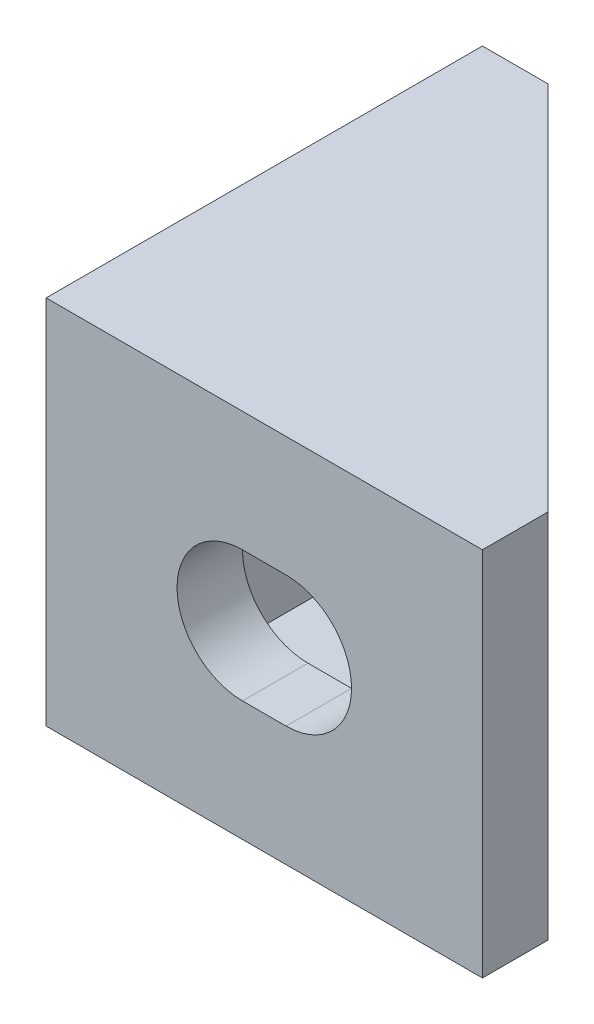
ISO-10303-21;
HEADER;
FILE_DESCRIPTION(('STEP AP214'),'2;1');
FILE_NAME('part.step','',(''),(''),'','','');
FILE_SCHEMA(('AUTOMOTIVE_DESIGN { 1 0 10303 214 1 1 1 1 }'));
ENDSEC;
DATA;
#1=APPLICATION_CONTEXT('core data for automotive mechanical design processes');
#2=APPLICATION_PROTOCOL_DEFINITION('international standard','automotive_design',2000,#1);
#3=PRODUCT_CONTEXT('',#1,'mechanical');
#4=PRODUCT('Part','Part','',(#3));
#5=PRODUCT_RELATED_PRODUCT_CATEGORY('part','',(#4));
#6=PRODUCT_DEFINITION_FORMATION('','',#4);
#7=PRODUCT_DEFINITION_CONTEXT('part definition',#1,'design');
#8=PRODUCT_DEFINITION('design','',#6,#7);
#9=PRODUCT_DEFINITION_SHAPE('','',#8);
#10=(LENGTH_UNIT() NAMED_UNIT(*) SI_UNIT(.MILLI.,.METRE.));
#11=(NAMED_UNIT(*) PLANE_ANGLE_UNIT() SI_UNIT($,.RADIAN.));
#12=(NAMED_UNIT(*) SI_UNIT($,.STERADIAN.) SOLID_ANGLE_UNIT());
#13=UNCERTAINTY_MEASURE_WITH_UNIT(LENGTH_MEASURE(1.E-05),#10,'distance_accuracy_value','');
#14=(GEOMETRIC_REPRESENTATION_CONTEXT(3) GLOBAL_UNCERTAINTY_ASSIGNED_CONTEXT((#13)) GLOBAL_UNIT_ASSIGNED_CONTEXT((#10,
#11,#12)) REPRESENTATION_CONTEXT('',''));
#15=CARTESIAN_POINT('',(0.,0.,0.));
#16=DIRECTION('',(0.,0.,1.));
#17=DIRECTION('',(1.,0.,0.));
#18=AXIS2_PLACEMENT_3D('',#15,#16,#17);
#19=CARTESIAN_POINT('',(20.,17.,-3.));
#20=DIRECTION('',(-0.707106781186548,0.,0.707106781186548));
#21=DIRECTION('',(0.707106781186548,0.,0.707106781186548));
#22=AXIS2_PLACEMENT_3D('',#19,#20,#21);
#23=PLANE('',#22);
#24=DIRECTION('',(0.,-1.,0.));
#25=VECTOR('',#24,1.);
#26=CARTESIAN_POINT('',(3.,17.,-20.));
#27=LINE('',#26,#25);
#28=CARTESIAN_POINT('',(3.,2.,-20.));
#29=VERTEX_POINT('',#28);
#30=CARTESIAN_POINT('',(3.,0.,-20.));
#31=VERTEX_POINT('',#30);
#32=EDGE_CURVE('E258',#29,#31,#27,.T.);
#33=ORIENTED_EDGE('',*,*,#32,.F.);
#34=DIRECTION('',(0.707106781186548,0.,0.707106781186548));
#35=VECTOR('',#34,1.);
#36=CARTESIAN_POINT('',(20.,2.,-3.));
#37=LINE('',#36,#35);
#38=CARTESIAN_POINT('',(20.,2.,-3.));
#39=VERTEX_POINT('',#38);
#40=EDGE_CURVE('E11',#29,#39,#37,.T.);
#41=ORIENTED_EDGE('',*,*,#40,.T.);
#42=DIRECTION('',(0.,-1.,0.));
#43=VECTOR('',#42,1.);
#44=CARTESIAN_POINT('',(20.,17.,-3.));
#45=LINE('',#44,#43);
#46=CARTESIAN_POINT('',(20.,0.,-3.));
#47=VERTEX_POINT('',#46);
#48=EDGE_CURVE('E262',#39,#47,#45,.T.);
#49=ORIENTED_EDGE('',*,*,#48,.T.);
#50=DIRECTION('',(-0.707106781186547,0.,-0.707106781186547));
#51=VECTOR('',#50,1.);
#52=CARTESIAN_POINT('',(20.,0.,-3.));
#53=LINE('',#52,#51);
#54=EDGE_CURVE('E252',#47,#31,#53,.T.);
#55=ORIENTED_EDGE('',*,*,#54,.T.);
#56=EDGE_LOOP('',(#33,#41,#49,#55));
#57=FACE_BOUND('',#56,.T.);
#58=ADVANCED_FACE('F33',(#57),#23,.F.);
#59=CARTESIAN_POINT('',(0.,17.,-20.));
#60=DIRECTION('',(1.,0.,0.));
#61=DIRECTION('',(0.,0.,-1.));
#62=AXIS2_PLACEMENT_3D('',#59,#60,#61);
#63=PLANE('',#62);
#64=DIRECTION('',(0.,0.,-1.));
#65=VECTOR('',#64,1.);
#66=CARTESIAN_POINT('',(0.,11.5,-9.));
#67=LINE('',#66,#65);
#68=CARTESIAN_POINT('',(0.,11.5,-9.));
#69=VERTEX_POINT('',#68);
#70=CARTESIAN_POINT('',(0.,11.5,-11.));
#71=VERTEX_POINT('',#70);
#72=EDGE_CURVE('E184',#69,#71,#67,.T.);
#73=ORIENTED_EDGE('',*,*,#72,.F.);
#74=CARTESIAN_POINT('',(0.,8.5,-9.));
#75=DIRECTION('',(1.,0.,0.));
#76=DIRECTION('',(0.,0.,-1.));
#77=AXIS2_PLACEMENT_3D('',#74,#75,#76);
#78=CIRCLE('',#77,3.);
#79=CARTESIAN_POINT('',(0.,5.5,-9.));
#80=VERTEX_POINT('',#79);
#81=EDGE_CURVE('E187',#80,#69,#78,.F.);
#82=ORIENTED_EDGE('',*,*,#81,.F.);
#83=DIRECTION('',(0.,0.,1.));
#84=VECTOR('',#83,1.);
#85=CARTESIAN_POINT('',(0.,5.5,-9.));
#86=LINE('',#85,#84);
#87=CARTESIAN_POINT('',(0.,5.5,-11.));
#88=VERTEX_POINT('',#87);
#89=EDGE_CURVE('E204',#88,#80,#86,.T.);
#90=ORIENTED_EDGE('',*,*,#89,.F.);
#91=CARTESIAN_POINT('',(0.,8.5,-11.));
#92=DIRECTION('',(1.,0.,0.));
#93=DIRECTION('',(0.,0.,-1.));
#94=AXIS2_PLACEMENT_3D('',#91,#92,#93);
#95=CIRCLE('',#94,3.);
#96=EDGE_CURVE('E160',#71,#88,#95,.F.);
#97=ORIENTED_EDGE('',*,*,#96,.F.);
#98=EDGE_LOOP('',(#73,#82,#90,#97));
#99=FACE_BOUND('',#98,.T.);
#100=DIRECTION('',(0.,0.,1.));
#101=VECTOR('',#100,1.);
#102=CARTESIAN_POINT('',(0.,0.,-20.));
#103=LINE('',#102,#101);
#104=CARTESIAN_POINT('',(0.,0.,-20.));
#105=VERTEX_POINT('',#104);
#106=CARTESIAN_POINT('',(0.,0.,0.));
#107=VERTEX_POINT('',#106);
#108=EDGE_CURVE('E230',#105,#107,#103,.T.);
#109=ORIENTED_EDGE('',*,*,#108,.T.);
#110=DIRECTION('',(0.,-1.,0.));
#111=VECTOR('',#110,1.);
#112=CARTESIAN_POINT('',(0.,17.,0.));
#113=LINE('',#112,#111);
#114=CARTESIAN_POINT('',(0.,17.,0.));
#115=VERTEX_POINT('',#114);
#116=EDGE_CURVE('E269',#115,#107,#113,.T.);
#117=ORIENTED_EDGE('',*,*,#116,.F.);
#118=DIRECTION('',(0.,0.,1.));
#119=VECTOR('',#118,1.);
#120=CARTESIAN_POINT('',(0.,17.,-20.));
#121=LINE('',#120,#119);
#122=CARTESIAN_POINT('',(0.,17.,-20.));
#123=VERTEX_POINT('',#122);
#124=EDGE_CURVE('E232',#123,#115,#121,.T.);
#125=ORIENTED_EDGE('',*,*,#124,.F.);
#126=DIRECTION('',(0.,-1.,0.));
#127=VECTOR('',#126,1.);
#128=CARTESIAN_POINT('',(0.,17.,-20.));
#129=LINE('',#128,#127);
#130=EDGE_CURVE('E244',#123,#105,#129,.T.);
#131=ORIENTED_EDGE('',*,*,#130,.T.);
#132=EDGE_LOOP('',(#109,#117,#125,#131));
#133=FACE_BOUND('',#132,.T.);
#134=ADVANCED_FACE('F35',(#99,#133),#63,.F.);
#135=CARTESIAN_POINT('',(0.,17.,0.));
#136=DIRECTION('',(0.,0.,-1.));
#137=DIRECTION('',(-1.,0.,0.));
#138=AXIS2_PLACEMENT_3D('',#135,#136,#137);
#139=PLANE('',#138);
#140=DIRECTION('',(-1.,0.,0.));
#141=VECTOR('',#140,1.);
#142=CARTESIAN_POINT('',(11.,11.5,0.));
#143=LINE('',#142,#141);
#144=CARTESIAN_POINT('',(11.,11.5,0.));
#145=VERTEX_POINT('',#144);
#146=CARTESIAN_POINT('',(9.,11.5,0.));
#147=VERTEX_POINT('',#146);
#148=EDGE_CURVE('E166',#145,#147,#143,.T.);
#149=ORIENTED_EDGE('',*,*,#148,.F.);
#150=CARTESIAN_POINT('',(11.,8.5,0.));
#151=DIRECTION('',(0.,0.,-1.));
#152=DIRECTION('',(-1.,0.,0.));
#153=AXIS2_PLACEMENT_3D('',#150,#151,#152);
#154=CIRCLE('',#153,3.);
#155=CARTESIAN_POINT('',(11.,5.5,0.));
#156=VERTEX_POINT('',#155);
#157=EDGE_CURVE('E148',#156,#145,#154,.F.);
#158=ORIENTED_EDGE('',*,*,#157,.F.);
#159=DIRECTION('',(1.,0.,0.));
#160=VECTOR('',#159,1.);
#161=CARTESIAN_POINT('',(11.,5.5,0.));
#162=LINE('',#161,#160);
#163=CARTESIAN_POINT('',(9.,5.5,0.));
#164=VERTEX_POINT('',#163);
#165=EDGE_CURVE('E157',#164,#156,#162,.T.);
#166=ORIENTED_EDGE('',*,*,#165,.F.);
#167=CARTESIAN_POINT('',(9.,8.5,0.));
#168=DIRECTION('',(0.,0.,-1.));
#169=DIRECTION('',(-1.,0.,0.));
#170=AXIS2_PLACEMENT_3D('',#167,#168,#169);
#171=CIRCLE('',#170,3.);
#172=EDGE_CURVE('E48',#147,#164,#171,.F.);
#173=ORIENTED_EDGE('',*,*,#172,.F.);
#174=EDGE_LOOP('',(#149,#158,#166,#173));
#175=FACE_BOUND('',#174,.T.);
#176=DIRECTION('',(1.,0.,0.));
#177=VECTOR('',#176,1.);
#178=CARTESIAN_POINT('',(0.,0.,0.));
#179=LINE('',#178,#177);
#180=CARTESIAN_POINT('',(20.,0.,0.));
#181=VERTEX_POINT('',#180);
#182=EDGE_CURVE('E247',#107,#181,#179,.T.);
#183=ORIENTED_EDGE('',*,*,#182,.T.);
#184=DIRECTION('',(0.,-1.,0.));
#185=VECTOR('',#184,1.);
#186=CARTESIAN_POINT('',(20.,17.,0.));
#187=LINE('',#186,#185);
#188=CARTESIAN_POINT('',(20.,17.,0.));
#189=VERTEX_POINT('',#188);
#190=EDGE_CURVE('E266',#189,#181,#187,.T.);
#191=ORIENTED_EDGE('',*,*,#190,.F.);
#192=DIRECTION('',(1.,0.,0.));
#193=VECTOR('',#192,1.);
#194=CARTESIAN_POINT('',(0.,17.,0.));
#195=LINE('',#194,#193);
#196=EDGE_CURVE('E235',#115,#189,#195,.T.);
#197=ORIENTED_EDGE('',*,*,#196,.F.);
#198=ORIENTED_EDGE('',*,*,#116,.T.);
#199=EDGE_LOOP('',(#183,#191,#197,#198));
#200=FACE_BOUND('',#199,.T.);
#201=ADVANCED_FACE('F163',(#175,#200),#139,.F.);
#202=CARTESIAN_POINT('',(20.,17.,0.));
#203=DIRECTION('',(-1.,0.,0.));
#204=DIRECTION('',(0.,0.,1.));
#205=AXIS2_PLACEMENT_3D('',#202,#203,#204);
#206=PLANE('',#205);
#207=DIRECTION('',(0.,0.,-1.));
#208=VECTOR('',#207,1.);
#209=CARTESIAN_POINT('',(20.,0.,0.));
#210=LINE('',#209,#208);
#211=EDGE_CURVE('E249',#181,#47,#210,.T.);
#212=ORIENTED_EDGE('',*,*,#211,.T.);
#213=ORIENTED_EDGE('',*,*,#48,.F.);
#214=DIRECTION('',(0.,-1.,0.));
#215=VECTOR('',#214,1.);
#216=CARTESIAN_POINT('',(20.,15.,-3.));
#217=LINE('',#216,#215);
#218=CARTESIAN_POINT('',(20.,15.,-3.));
#219=VERTEX_POINT('',#218);
#220=EDGE_CURVE('E220',#219,#39,#217,.T.);
#221=ORIENTED_EDGE('',*,*,#220,.F.);
#222=CARTESIAN_POINT('',(20.,17.,-3.));
#223=VERTEX_POINT('',#222);
#224=EDGE_CURVE('E263',#223,#219,#45,.T.);
#225=ORIENTED_EDGE('',*,*,#224,.F.);
#226=DIRECTION('',(0.,0.,-1.));
#227=VECTOR('',#226,1.);
#228=CARTESIAN_POINT('',(20.,17.,0.));
#229=LINE('',#228,#227);
#230=EDGE_CURVE('E238',#189,#223,#229,.T.);
#231=ORIENTED_EDGE('',*,*,#230,.F.);
#232=ORIENTED_EDGE('',*,*,#190,.T.);
#233=EDGE_LOOP('',(#212,#213,#221,#225,#231,#232));
#234=FACE_BOUND('',#233,.T.);
#235=ADVANCED_FACE('F292',(#234),#206,.F.);
#236=ORIENTED_EDGE('',*,*,#224,.T.);
#237=DIRECTION('',(-0.707106781186548,0.,-0.707106781186548));
#238=VECTOR('',#237,1.);
#239=CARTESIAN_POINT('',(20.,15.,-3.));
#240=LINE('',#239,#238);
#241=CARTESIAN_POINT('',(3.,15.,-20.));
#242=VERTEX_POINT('',#241);
#243=EDGE_CURVE('E41',#219,#242,#240,.T.);
#244=ORIENTED_EDGE('',*,*,#243,.T.);
#245=CARTESIAN_POINT('',(3.,17.,-20.));
#246=VERTEX_POINT('',#245);
#247=EDGE_CURVE('E259',#246,#242,#27,.T.);
#248=ORIENTED_EDGE('',*,*,#247,.F.);
#249=DIRECTION('',(-0.707106781186547,0.,-0.707106781186547));
#250=VECTOR('',#249,1.);
#251=CARTESIAN_POINT('',(20.,17.,-3.));
#252=LINE('',#251,#250);
#253=EDGE_CURVE('E240',#223,#246,#252,.T.);
#254=ORIENTED_EDGE('',*,*,#253,.F.);
#255=EDGE_LOOP('',(#236,#244,#248,#254));
#256=FACE_BOUND('',#255,.T.);
#257=ADVANCED_FACE('F274',(#256),#23,.F.);
#258=CARTESIAN_POINT('',(3.,17.,-20.));
#259=DIRECTION('',(0.,0.,1.));
#260=DIRECTION('',(1.,0.,0.));
#261=AXIS2_PLACEMENT_3D('',#258,#259,#260);
#262=PLANE('',#261);
#263=DIRECTION('',(-1.,0.,0.));
#264=VECTOR('',#263,1.);
#265=CARTESIAN_POINT('',(3.,0.,-20.));
#266=LINE('',#265,#264);
#267=EDGE_CURVE('E236',#31,#105,#266,.T.);
#268=ORIENTED_EDGE('',*,*,#267,.T.);
#269=ORIENTED_EDGE('',*,*,#130,.F.);
#270=DIRECTION('',(-1.,0.,0.));
#271=VECTOR('',#270,1.);
#272=CARTESIAN_POINT('',(3.,17.,-20.));
#273=LINE('',#272,#271);
#274=EDGE_CURVE('E242',#246,#123,#273,.T.);
#275=ORIENTED_EDGE('',*,*,#274,.F.);
#276=ORIENTED_EDGE('',*,*,#247,.T.);
#277=DIRECTION('',(0.,1.,0.));
#278=VECTOR('',#277,1.);
#279=CARTESIAN_POINT('',(3.,2.,-20.));
#280=LINE('',#279,#278);
#281=EDGE_CURVE('E213',#29,#242,#280,.T.);
#282=ORIENTED_EDGE('',*,*,#281,.F.);
#283=ORIENTED_EDGE('',*,*,#32,.T.);
#284=EDGE_LOOP('',(#268,#269,#275,#276,#282,#283));
#285=FACE_BOUND('',#284,.T.);
#286=ADVANCED_FACE('F282',(#285),#262,.F.);
#287=CARTESIAN_POINT('',(0.,17.,0.));
#288=DIRECTION('',(0.,1.,0.));
#289=DIRECTION('',(0.,0.,1.));
#290=AXIS2_PLACEMENT_3D('',#287,#288,#289);
#291=PLANE('',#290);
#292=ORIENTED_EDGE('',*,*,#124,.T.);
#293=ORIENTED_EDGE('',*,*,#196,.T.);
#294=ORIENTED_EDGE('',*,*,#230,.T.);
#295=ORIENTED_EDGE('',*,*,#253,.T.);
#296=ORIENTED_EDGE('',*,*,#274,.T.);
#297=EDGE_LOOP('',(#292,#293,#294,#295,#296));
#298=FACE_BOUND('',#297,.T.);
#299=ADVANCED_FACE('F286',(#298),#291,.T.);
#300=CARTESIAN_POINT('',(0.,0.,0.));
#301=DIRECTION('',(0.,1.,0.));
#302=DIRECTION('',(0.,0.,1.));
#303=AXIS2_PLACEMENT_3D('',#300,#301,#302);
#304=PLANE('',#303);
#305=ORIENTED_EDGE('',*,*,#108,.F.);
#306=ORIENTED_EDGE('',*,*,#267,.F.);
#307=ORIENTED_EDGE('',*,*,#54,.F.);
#308=ORIENTED_EDGE('',*,*,#211,.F.);
#309=ORIENTED_EDGE('',*,*,#182,.F.);
#310=EDGE_LOOP('',(#305,#306,#307,#308,#309));
#311=FACE_BOUND('',#310,.T.);
#312=ADVANCED_FACE('F308',(#311),#304,.F.);
#313=CARTESIAN_POINT('',(20.,2.,-3.));
#314=DIRECTION('',(0.,-1.,0.));
#315=DIRECTION('',(0.,0.,-1.));
#316=AXIS2_PLACEMENT_3D('',#313,#314,#315);
#317=PLANE('',#316);
#318=DIRECTION('',(0.,0.,-1.));
#319=VECTOR('',#318,1.);
#320=CARTESIAN_POINT('',(3.,2.,-3.));
#321=LINE('',#320,#319);
#322=CARTESIAN_POINT('',(3.,2.,-3.));
#323=VERTEX_POINT('',#322);
#324=EDGE_CURVE('E228',#323,#29,#321,.T.);
#325=ORIENTED_EDGE('',*,*,#324,.F.);
#326=DIRECTION('',(-1.,0.,0.));
#327=VECTOR('',#326,1.);
#328=CARTESIAN_POINT('',(20.,2.,-3.));
#329=LINE('',#328,#327);
#330=EDGE_CURVE('E222',#39,#323,#329,.T.);
#331=ORIENTED_EDGE('',*,*,#330,.F.);
#332=ORIENTED_EDGE('',*,*,#40,.F.);
#333=EDGE_LOOP('',(#325,#331,#332));
#334=FACE_BOUND('',#333,.T.);
#335=ADVANCED_FACE('F299',(#334),#317,.F.);
#336=CARTESIAN_POINT('',(3.,15.,-3.));
#337=DIRECTION('',(0.,1.,0.));
#338=DIRECTION('',(-1.,0.,0.));
#339=AXIS2_PLACEMENT_3D('',#336,#337,#338);
#340=PLANE('',#339);
#341=DIRECTION('',(1.,0.,0.));
#342=VECTOR('',#341,1.);
#343=CARTESIAN_POINT('',(3.,15.,-3.));
#344=LINE('',#343,#342);
#345=CARTESIAN_POINT('',(3.,15.,-3.));
#346=VERTEX_POINT('',#345);
#347=EDGE_CURVE('E217',#346,#219,#344,.T.);
#348=ORIENTED_EDGE('',*,*,#347,.F.);
#349=DIRECTION('',(0.,0.,-1.));
#350=VECTOR('',#349,1.);
#351=CARTESIAN_POINT('',(3.,15.,-3.));
#352=LINE('',#351,#350);
#353=EDGE_CURVE('E225',#346,#242,#352,.T.);
#354=ORIENTED_EDGE('',*,*,#353,.T.);
#355=ORIENTED_EDGE('',*,*,#243,.F.);
#356=EDGE_LOOP('',(#348,#354,#355));
#357=FACE_BOUND('',#356,.T.);
#358=ADVANCED_FACE('F336',(#357),#340,.F.);
#359=CARTESIAN_POINT('',(3.,2.,-3.));
#360=DIRECTION('',(-1.,0.,0.));
#361=DIRECTION('',(0.,0.,1.));
#362=AXIS2_PLACEMENT_3D('',#359,#360,#361);
#363=PLANE('',#362);
#364=DIRECTION('',(0.,0.,-1.));
#365=VECTOR('',#364,1.);
#366=CARTESIAN_POINT('',(3.,5.5,-9.));
#367=LINE('',#366,#365);
#368=CARTESIAN_POINT('',(3.,5.5,-9.));
#369=VERTEX_POINT('',#368);
#370=CARTESIAN_POINT('',(3.,5.5,-11.));
#371=VERTEX_POINT('',#370);
#372=EDGE_CURVE('E192',#369,#371,#367,.T.);
#373=ORIENTED_EDGE('',*,*,#372,.F.);
#374=CARTESIAN_POINT('',(3.,8.5,-9.));
#375=DIRECTION('',(1.,0.,0.));
#376=DIRECTION('',(0.,0.,-1.));
#377=AXIS2_PLACEMENT_3D('',#374,#375,#376);
#378=CIRCLE('',#377,3.);
#379=CARTESIAN_POINT('',(3.,11.5,-9.));
#380=VERTEX_POINT('',#379);
#381=EDGE_CURVE('E190',#380,#369,#378,.T.);
#382=ORIENTED_EDGE('',*,*,#381,.F.);
#383=DIRECTION('',(0.,0.,1.));
#384=VECTOR('',#383,1.);
#385=CARTESIAN_POINT('',(3.,11.5,-9.));
#386=LINE('',#385,#384);
#387=CARTESIAN_POINT('',(3.,11.5,-11.));
#388=VERTEX_POINT('',#387);
#389=EDGE_CURVE('E198',#388,#380,#386,.T.);
#390=ORIENTED_EDGE('',*,*,#389,.F.);
#391=CARTESIAN_POINT('',(3.,8.5,-11.));
#392=DIRECTION('',(1.,0.,0.));
#393=DIRECTION('',(0.,0.,-1.));
#394=AXIS2_PLACEMENT_3D('',#391,#392,#393);
#395=CIRCLE('',#394,3.);
#396=EDGE_CURVE('E195',#371,#388,#395,.T.);
#397=ORIENTED_EDGE('',*,*,#396,.F.);
#398=EDGE_LOOP('',(#373,#382,#390,#397));
#399=FACE_BOUND('',#398,.T.);
#400=ORIENTED_EDGE('',*,*,#281,.T.);
#401=ORIENTED_EDGE('',*,*,#353,.F.);
#402=DIRECTION('',(0.,1.,0.));
#403=VECTOR('',#402,1.);
#404=CARTESIAN_POINT('',(3.,2.,-3.));
#405=LINE('',#404,#403);
#406=EDGE_CURVE('E214',#323,#346,#405,.T.);
#407=ORIENTED_EDGE('',*,*,#406,.F.);
#408=ORIENTED_EDGE('',*,*,#324,.T.);
#409=EDGE_LOOP('',(#400,#401,#407,#408));
#410=FACE_BOUND('',#409,.T.);
#411=ADVANCED_FACE('F333',(#399,#410),#363,.F.);
#412=CARTESIAN_POINT('',(0.,0.,-3.));
#413=DIRECTION('',(0.,0.,-1.));
#414=DIRECTION('',(-1.,0.,0.));
#415=AXIS2_PLACEMENT_3D('',#412,#413,#414);
#416=PLANE('',#415);
#417=CARTESIAN_POINT('',(11.,8.5,-3.));
#418=DIRECTION('',(0.,0.,-1.));
#419=DIRECTION('',(-1.,0.,0.));
#420=AXIS2_PLACEMENT_3D('',#417,#418,#419);
#421=CIRCLE('',#420,3.);
#422=CARTESIAN_POINT('',(11.,11.5,-3.));
#423=VERTEX_POINT('',#422);
#424=CARTESIAN_POINT('',(11.,5.5,-3.));
#425=VERTEX_POINT('',#424);
#426=EDGE_CURVE('E56',#423,#425,#421,.T.);
#427=ORIENTED_EDGE('',*,*,#426,.F.);
#428=DIRECTION('',(1.,0.,0.));
#429=VECTOR('',#428,1.);
#430=CARTESIAN_POINT('',(11.,11.5,-3.));
#431=LINE('',#430,#429);
#432=CARTESIAN_POINT('',(9.,11.5,-3.));
#433=VERTEX_POINT('',#432);
#434=EDGE_CURVE('E154',#433,#423,#431,.T.);
#435=ORIENTED_EDGE('',*,*,#434,.F.);
#436=CARTESIAN_POINT('',(9.,8.5,-3.));
#437=DIRECTION('',(0.,0.,-1.));
#438=DIRECTION('',(-1.,0.,0.));
#439=AXIS2_PLACEMENT_3D('',#436,#437,#438);
#440=CIRCLE('',#439,3.);
#441=CARTESIAN_POINT('',(9.,5.5,-3.));
#442=VERTEX_POINT('',#441);
#443=EDGE_CURVE('E174',#442,#433,#440,.T.);
#444=ORIENTED_EDGE('',*,*,#443,.F.);
#445=DIRECTION('',(-1.,0.,0.));
#446=VECTOR('',#445,1.);
#447=CARTESIAN_POINT('',(11.,5.5,-3.));
#448=LINE('',#447,#446);
#449=EDGE_CURVE('E168',#425,#442,#448,.T.);
#450=ORIENTED_EDGE('',*,*,#449,.F.);
#451=EDGE_LOOP('',(#427,#435,#444,#450));
#452=FACE_BOUND('',#451,.T.);
#453=ORIENTED_EDGE('',*,*,#406,.T.);
#454=ORIENTED_EDGE('',*,*,#347,.T.);
#455=ORIENTED_EDGE('',*,*,#220,.T.);
#456=ORIENTED_EDGE('',*,*,#330,.T.);
#457=EDGE_LOOP('',(#453,#454,#455,#456));
#458=FACE_BOUND('',#457,.T.);
#459=ADVANCED_FACE('F296',(#452,#458),#416,.T.);
#460=CARTESIAN_POINT('',(-0.00100000000000013,8.5,-9.));
#461=DIRECTION('',(1.,0.,0.));
#462=DIRECTION('',(0.,0.,-1.));
#463=AXIS2_PLACEMENT_3D('',#460,#461,#462);
#464=CYLINDRICAL_SURFACE('',#463,3.);
#465=ORIENTED_EDGE('',*,*,#81,.T.);
#466=DIRECTION('',(1.,0.,0.));
#467=VECTOR('',#466,1.);
#468=CARTESIAN_POINT('',(-0.00100000000000013,11.5,-9.));
#469=LINE('',#468,#467);
#470=EDGE_CURVE('E202',#69,#380,#469,.T.);
#471=ORIENTED_EDGE('',*,*,#470,.T.);
#472=ORIENTED_EDGE('',*,*,#381,.T.);
#473=DIRECTION('',(1.,0.,0.));
#474=VECTOR('',#473,1.);
#475=CARTESIAN_POINT('',(-0.00100000000000013,5.5,-9.));
#476=LINE('',#475,#474);
#477=EDGE_CURVE('E201',#80,#369,#476,.T.);
#478=ORIENTED_EDGE('',*,*,#477,.F.);
#479=EDGE_LOOP('',(#465,#471,#472,#478));
#480=FACE_BOUND('',#479,.T.);
#481=ADVANCED_FACE('F344',(#480),#464,.F.);
#482=CARTESIAN_POINT('',(-0.00100000000000013,11.5,-9.));
#483=DIRECTION('',(0.,1.,0.));
#484=DIRECTION('',(0.,0.,1.));
#485=AXIS2_PLACEMENT_3D('',#482,#483,#484);
#486=PLANE('',#485);
#487=ORIENTED_EDGE('',*,*,#72,.T.);
#488=DIRECTION('',(1.,0.,0.));
#489=VECTOR('',#488,1.);
#490=CARTESIAN_POINT('',(-0.00100000000000013,11.5,-11.));
#491=LINE('',#490,#489);
#492=EDGE_CURVE('E205',#71,#388,#491,.T.);
#493=ORIENTED_EDGE('',*,*,#492,.T.);
#494=ORIENTED_EDGE('',*,*,#389,.T.);
#495=ORIENTED_EDGE('',*,*,#470,.F.);
#496=EDGE_LOOP('',(#487,#493,#494,#495));
#497=FACE_BOUND('',#496,.T.);
#498=ADVANCED_FACE('F348',(#497),#486,.F.);
#499=CARTESIAN_POINT('',(-0.00100000000000013,8.5,-11.));
#500=DIRECTION('',(1.,0.,0.));
#501=DIRECTION('',(0.,0.,-1.));
#502=AXIS2_PLACEMENT_3D('',#499,#500,#501);
#503=CYLINDRICAL_SURFACE('',#502,3.);
#504=ORIENTED_EDGE('',*,*,#96,.T.);
#505=DIRECTION('',(1.,0.,0.));
#506=VECTOR('',#505,1.);
#507=CARTESIAN_POINT('',(-0.00100000000000013,5.5,-11.));
#508=LINE('',#507,#506);
#509=EDGE_CURVE('E207',#88,#371,#508,.T.);
#510=ORIENTED_EDGE('',*,*,#509,.T.);
#511=ORIENTED_EDGE('',*,*,#396,.T.);
#512=ORIENTED_EDGE('',*,*,#492,.F.);
#513=EDGE_LOOP('',(#504,#510,#511,#512));
#514=FACE_BOUND('',#513,.T.);
#515=ADVANCED_FACE('F353',(#514),#503,.F.);
#516=CARTESIAN_POINT('',(-0.00100000000000013,5.5,-9.));
#517=DIRECTION('',(0.,-1.,0.));
#518=DIRECTION('',(0.,0.,-1.));
#519=AXIS2_PLACEMENT_3D('',#516,#517,#518);
#520=PLANE('',#519);
#521=ORIENTED_EDGE('',*,*,#89,.T.);
#522=ORIENTED_EDGE('',*,*,#477,.T.);
#523=ORIENTED_EDGE('',*,*,#372,.T.);
#524=ORIENTED_EDGE('',*,*,#509,.F.);
#525=EDGE_LOOP('',(#521,#522,#523,#524));
#526=FACE_BOUND('',#525,.T.);
#527=ADVANCED_FACE('F350',(#526),#520,.F.);
#528=CARTESIAN_POINT('',(11.,8.5,0.00100000000000013));
#529=DIRECTION('',(0.,0.,-1.));
#530=DIRECTION('',(-1.,0.,0.));
#531=AXIS2_PLACEMENT_3D('',#528,#529,#530);
#532=CYLINDRICAL_SURFACE('',#531,3.);
#533=ORIENTED_EDGE('',*,*,#157,.T.);
#534=DIRECTION('',(0.,0.,-1.));
#535=VECTOR('',#534,1.);
#536=CARTESIAN_POINT('',(11.,11.5,0.00100000000000013));
#537=LINE('',#536,#535);
#538=EDGE_CURVE('E161',#145,#423,#537,.T.);
#539=ORIENTED_EDGE('',*,*,#538,.T.);
#540=ORIENTED_EDGE('',*,*,#426,.T.);
#541=DIRECTION('',(0.,0.,-1.));
#542=VECTOR('',#541,1.);
#543=CARTESIAN_POINT('',(11.,5.5,0.00100000000000013));
#544=LINE('',#543,#542);
#545=EDGE_CURVE('E144',#156,#425,#544,.T.);
#546=ORIENTED_EDGE('',*,*,#545,.F.);
#547=EDGE_LOOP('',(#533,#539,#540,#546));
#548=FACE_BOUND('',#547,.T.);
#549=ADVANCED_FACE('F146',(#548),#532,.F.);
#550=CARTESIAN_POINT('',(11.,11.5,0.00100000000000013));
#551=DIRECTION('',(0.,1.,0.));
#552=DIRECTION('',(0.,0.,1.));
#553=AXIS2_PLACEMENT_3D('',#550,#551,#552);
#554=PLANE('',#553);
#555=ORIENTED_EDGE('',*,*,#148,.T.);
#556=DIRECTION('',(0.,0.,-1.));
#557=VECTOR('',#556,1.);
#558=CARTESIAN_POINT('',(9.,11.5,0.00100000000000013));
#559=LINE('',#558,#557);
#560=EDGE_CURVE('E180',#147,#433,#559,.T.);
#561=ORIENTED_EDGE('',*,*,#560,.T.);
#562=ORIENTED_EDGE('',*,*,#434,.T.);
#563=ORIENTED_EDGE('',*,*,#538,.F.);
#564=EDGE_LOOP('',(#555,#561,#562,#563));
#565=FACE_BOUND('',#564,.T.);
#566=ADVANCED_FACE('F363',(#565),#554,.F.);
#567=CARTESIAN_POINT('',(9.,8.5,0.00100000000000013));
#568=DIRECTION('',(0.,0.,-1.));
#569=DIRECTION('',(-1.,0.,0.));
#570=AXIS2_PLACEMENT_3D('',#567,#568,#569);
#571=CYLINDRICAL_SURFACE('',#570,3.);
#572=ORIENTED_EDGE('',*,*,#172,.T.);
#573=DIRECTION('',(0.,0.,-1.));
#574=VECTOR('',#573,1.);
#575=CARTESIAN_POINT('',(9.,5.5,0.00100000000000013));
#576=LINE('',#575,#574);
#577=EDGE_CURVE('E153',#164,#442,#576,.T.);
#578=ORIENTED_EDGE('',*,*,#577,.T.);
#579=ORIENTED_EDGE('',*,*,#443,.T.);
#580=ORIENTED_EDGE('',*,*,#560,.F.);
#581=EDGE_LOOP('',(#572,#578,#579,#580));
#582=FACE_BOUND('',#581,.T.);
#583=ADVANCED_FACE('F366',(#582),#571,.F.);
#584=CARTESIAN_POINT('',(11.,5.5,0.00100000000000013));
#585=DIRECTION('',(0.,-1.,0.));
#586=DIRECTION('',(0.,0.,-1.));
#587=AXIS2_PLACEMENT_3D('',#584,#585,#586);
#588=PLANE('',#587);
#589=ORIENTED_EDGE('',*,*,#165,.T.);
#590=ORIENTED_EDGE('',*,*,#545,.T.);
#591=ORIENTED_EDGE('',*,*,#449,.T.);
#592=ORIENTED_EDGE('',*,*,#577,.F.);
#593=EDGE_LOOP('',(#589,#590,#591,#592));
#594=FACE_BOUND('',#593,.T.);
#595=ADVANCED_FACE('F158',(#594),#588,.F.);
#596=CLOSED_SHELL('',(#58,#134,#201,#235,#257,#286,#299,#312,#335,#358,#411,#459,#481,#498,#515,
#527,#549,#566,#583,#595));
#597=MANIFOLD_SOLID_BREP('B2',#596);
#598=ADVANCED_BREP_SHAPE_REPRESENTATION('',(#18,#597),#14);
#599=SHAPE_DEFINITION_REPRESENTATION(#9,#598);
ENDSEC;
END-ISO-10303-21;
